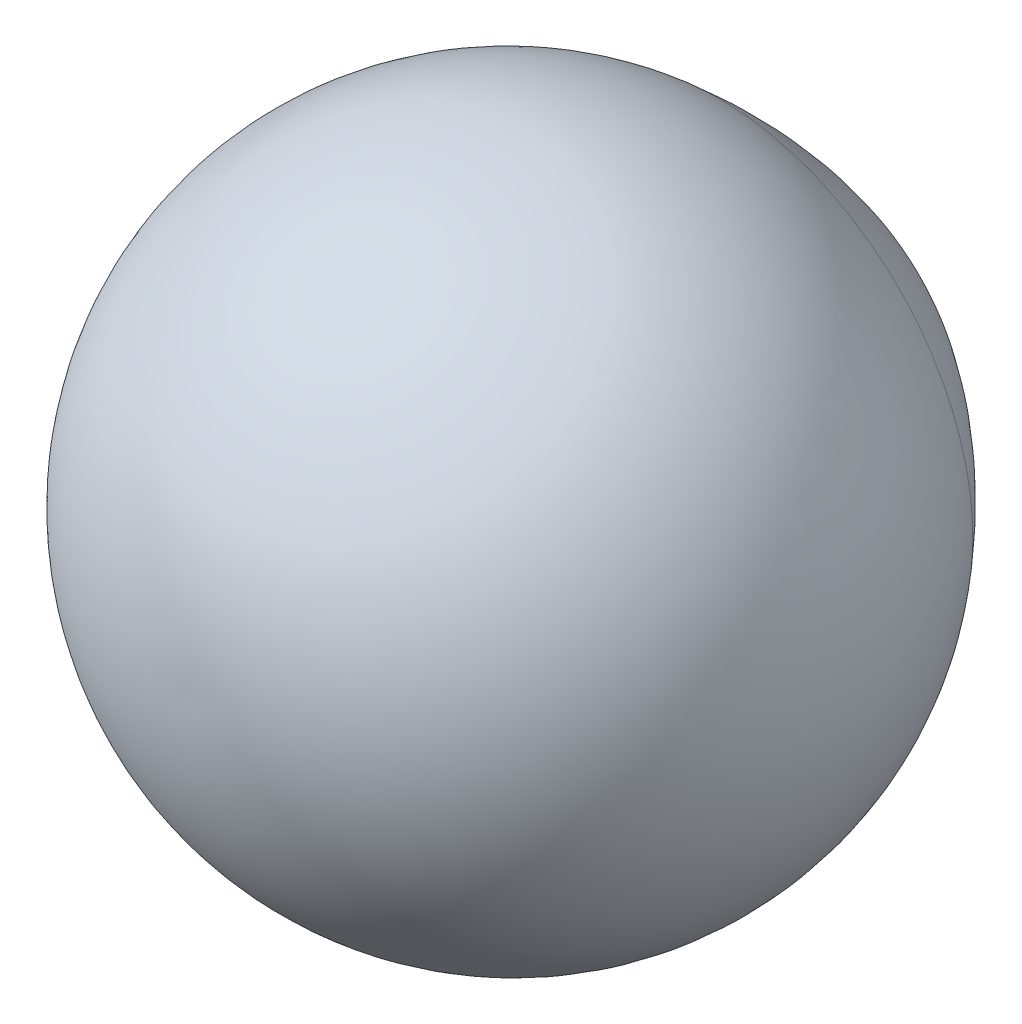
ISO-10303-21;
HEADER;
FILE_DESCRIPTION(('STEP AP214'),'2;1');
FILE_NAME('part.step','',(''),(''),'','','');
FILE_SCHEMA(('AUTOMOTIVE_DESIGN { 1 0 10303 214 1 1 1 1 }'));
ENDSEC;
DATA;
#1=APPLICATION_CONTEXT('core data for automotive mechanical design processes');
#2=APPLICATION_PROTOCOL_DEFINITION('international standard','automotive_design',2000,#1);
#3=PRODUCT_CONTEXT('',#1,'mechanical');
#4=PRODUCT('Part','Part','',(#3));
#5=PRODUCT_RELATED_PRODUCT_CATEGORY('part','',(#4));
#6=PRODUCT_DEFINITION_FORMATION('','',#4);
#7=PRODUCT_DEFINITION_CONTEXT('part definition',#1,'design');
#8=PRODUCT_DEFINITION('design','',#6,#7);
#9=PRODUCT_DEFINITION_SHAPE('','',#8);
#10=(LENGTH_UNIT() NAMED_UNIT(*) SI_UNIT(.MILLI.,.METRE.));
#11=(NAMED_UNIT(*) PLANE_ANGLE_UNIT() SI_UNIT($,.RADIAN.));
#12=(NAMED_UNIT(*) SI_UNIT($,.STERADIAN.) SOLID_ANGLE_UNIT());
#13=UNCERTAINTY_MEASURE_WITH_UNIT(LENGTH_MEASURE(1.E-05),#10,'distance_accuracy_value','');
#14=(GEOMETRIC_REPRESENTATION_CONTEXT(3) GLOBAL_UNCERTAINTY_ASSIGNED_CONTEXT((#13)) GLOBAL_UNIT_ASSIGNED_CONTEXT((#10,
#11,#12)) REPRESENTATION_CONTEXT('',''));
#15=CARTESIAN_POINT('',(0.,0.,0.));
#16=DIRECTION('',(0.,0.,1.));
#17=DIRECTION('',(1.,0.,0.));
#18=AXIS2_PLACEMENT_3D('',#15,#16,#17);
#19=CARTESIAN_POINT('',(9.03467718504539,85.846144947164,-450.05795560384));
#20=DIRECTION('',(0.,0.,1.));
#21=DIRECTION('',(0.,-1.,0.));
#22=AXIS2_PLACEMENT_3D('',#19,#20,#21);
#23=PLANE('',#22);
#24=CARTESIAN_POINT('',(-0.00012116504199581,85.846144947164,-450.05795560384));
#25=DIRECTION('',(0.,0.,1.));
#26=DIRECTION('',(0.,-1.,0.));
#27=AXIS2_PLACEMENT_3D('',#24,#25,#26);
#28=CIRCLE('',#27,9.03479835008739);
#29=CARTESIAN_POINT('',(-0.00012116504199581,76.8113465970766,-450.05795560384));
#30=VERTEX_POINT('',#29);
#31=EDGE_CURVE('E97',#30,#30,#28,.T.);
#32=ORIENTED_EDGE('',*,*,#31,.F.);
#33=EDGE_LOOP('',(#32));
#34=FACE_BOUND('',#33,.T.);
#35=ADVANCED_FACE('F65',(#34),#23,.F.);
#36=CARTESIAN_POINT('',(-0.00012116504199581,76.154056867591,44.7908283206817));
#37=DIRECTION('',(-1.,0.,0.));
#38=DIRECTION('',(0.,-1.,0.));
#39=AXIS2_PLACEMENT_3D('',#36,#37,#38);
#40=CIRCLE('',#39,405.267127286166);
#41=TRIMMED_CURVE('',#40,(PARAMETER_VALUE(-1.59471391485004)),
(PARAMETER_VALUE(1.59471391485004)),.T.,.PARAMETER.);
#42=CARTESIAN_POINT('',(-0.00012116504199581,85.8461449471622,44.7908283206817));
#43=DIRECTION('',(0.,0.,1.));
#44=AXIS1_PLACEMENT('',#42,#43);
#45=SURFACE_OF_REVOLUTION('',#41,#44);
#46=CARTESIAN_POINT('',(-0.000121165042051755,85.8461449471608,449.94204439616));
#47=VERTEX_POINT('',#46);
#48=VERTEX_LOOP('',#47);
#49=FACE_BOUND('',#48,.T.);
#50=CARTESIAN_POINT('',(-0.00012116504199581,85.8461449471632,-217.91963865682));
#51=DIRECTION('',(0.,0.,1.));
#52=DIRECTION('',(0.,-1.,0.));
#53=AXIS2_PLACEMENT_3D('',#50,#51,#52);
#54=CIRCLE('',#53,318.277011559712);
#55=CARTESIAN_POINT('',(-0.00012116504199581,-232.430866612549,-217.919638656821));
#56=VERTEX_POINT('',#55);
#57=EDGE_CURVE('E12',#56,#56,#54,.T.);
#58=ORIENTED_EDGE('',*,*,#57,.T.);
#59=EDGE_LOOP('',(#58));
#60=FACE_BOUND('',#59,.T.);
#61=ADVANCED_FACE('F67',(#49,#60),#45,.T.);
#62=CARTESIAN_POINT('',(-0.00012116504199581,85.8461449471616,228.62999125683));
#63=DIRECTION('',(0.,0.,1.));
#64=DIRECTION('',(0.,-1.,0.));
#65=AXIS2_PLACEMENT_3D('',#62,#63,#64);
#66=DEGENERATE_TOROIDAL_SURFACE('',#65,206.249037829823,688.864390474795,.F.);
#67=ORIENTED_EDGE('',*,*,#57,.F.);
#68=EDGE_LOOP('',(#67));
#69=FACE_BOUND('',#68,.T.);
#70=CARTESIAN_POINT('',(-0.00012116504199581,85.8461449471639,-425.152962227265));
#71=DIRECTION('',(0.,0.,1.));
#72=DIRECTION('',(0.,-1.,0.));
#73=AXIS2_PLACEMENT_3D('',#70,#71,#72);
#74=CIRCLE('',#73,10.7809098682421);
#75=CARTESIAN_POINT('',(-0.00012116504199581,75.0652350789218,-425.152962227265));
#76=VERTEX_POINT('',#75);
#77=EDGE_CURVE('E73',#76,#76,#74,.T.);
#78=ORIENTED_EDGE('',*,*,#77,.T.);
#79=EDGE_LOOP('',(#78));
#80=FACE_BOUND('',#79,.T.);
#81=ADVANCED_FACE('F78',(#69,#80),#66,.F.);
#82=CARTESIAN_POINT('',(-0.00012116504199581,85.8461449471624,-8.26788544009721));
#83=DIRECTION('',(0.,0.,1.));
#84=DIRECTION('',(0.,-1.,0.));
#85=AXIS2_PLACEMENT_3D('',#82,#83,#84);
#86=CYLINDRICAL_SURFACE('',#85,10.7809098682421);
#87=ORIENTED_EDGE('',*,*,#77,.F.);
#88=EDGE_LOOP('',(#87));
#89=FACE_BOUND('',#88,.T.);
#90=CARTESIAN_POINT('',(-0.00012116504199581,85.8461449471639,-444.580542206744));
#91=DIRECTION('',(0.,0.,1.));
#92=DIRECTION('',(0.,-1.,0.));
#93=AXIS2_PLACEMENT_3D('',#90,#91,#92);
#94=CIRCLE('',#93,10.7809098682421);
#95=CARTESIAN_POINT('',(-0.00012116504199581,75.0652350789218,-444.580542206744));
#96=VERTEX_POINT('',#95);
#97=EDGE_CURVE('E88',#96,#96,#94,.T.);
#98=ORIENTED_EDGE('',*,*,#97,.T.);
#99=EDGE_LOOP('',(#98));
#100=FACE_BOUND('',#99,.T.);
#101=ADVANCED_FACE('F83',(#89,#100),#86,.T.);
#102=CARTESIAN_POINT('',(-0.00012116504199581,85.8461449471639,-444.580542206744));
#103=DIRECTION('',(0.,0.,1.));
#104=DIRECTION('',(0.,-1.,0.));
#105=AXIS2_PLACEMENT_3D('',#102,#103,#104);
#106=TOROIDAL_SURFACE('',#105,16.7809098682421,6.);
#107=ORIENTED_EDGE('',*,*,#97,.F.);
#108=EDGE_LOOP('',(#107));
#109=FACE_BOUND('',#108,.T.);
#110=CARTESIAN_POINT('',(-0.00012116504199581,85.846144947164,-446.825184807946));
#111=DIRECTION('',(0.,0.,1.));
#112=DIRECTION('',(0.,-1.,0.));
#113=AXIS2_PLACEMENT_3D('',#110,#111,#112);
#114=CIRCLE('',#113,11.2165968295221);
#115=CARTESIAN_POINT('',(-0.00012116504199581,74.6295481176419,-446.825184807946));
#116=VERTEX_POINT('',#115);
#117=EDGE_CURVE('E91',#116,#116,#114,.T.);
#118=ORIENTED_EDGE('',*,*,#117,.T.);
#119=EDGE_LOOP('',(#118));
#120=FACE_BOUND('',#119,.T.);
#121=ADVANCED_FACE('F111',(#109,#120),#106,.F.);
#122=CARTESIAN_POINT('',(-0.00012116504199581,85.846144947164,-447.705321813197));
#123=DIRECTION('',(0.,0.,1.));
#124=DIRECTION('',(0.,-1.,0.));
#125=AXIS2_PLACEMENT_3D('',#122,#123,#124);
#126=TOROIDAL_SURFACE('',#125,9.03479835008739,2.35263379064301);
#127=ORIENTED_EDGE('',*,*,#117,.F.);
#128=EDGE_LOOP('',(#127));
#129=FACE_BOUND('',#128,.T.);
#130=ORIENTED_EDGE('',*,*,#31,.T.);
#131=EDGE_LOOP('',(#130));
#132=FACE_BOUND('',#131,.T.);
#133=ADVANCED_FACE('F102',(#129,#132),#126,.T.);
#134=CLOSED_SHELL('',(#35,#61,#81,#101,#121,#133));
#135=MANIFOLD_SOLID_BREP('B2',#134);
#136=ADVANCED_BREP_SHAPE_REPRESENTATION('',(#18,#135),#14);
#137=SHAPE_DEFINITION_REPRESENTATION(#9,#136);
ENDSEC;
END-ISO-10303-21;
